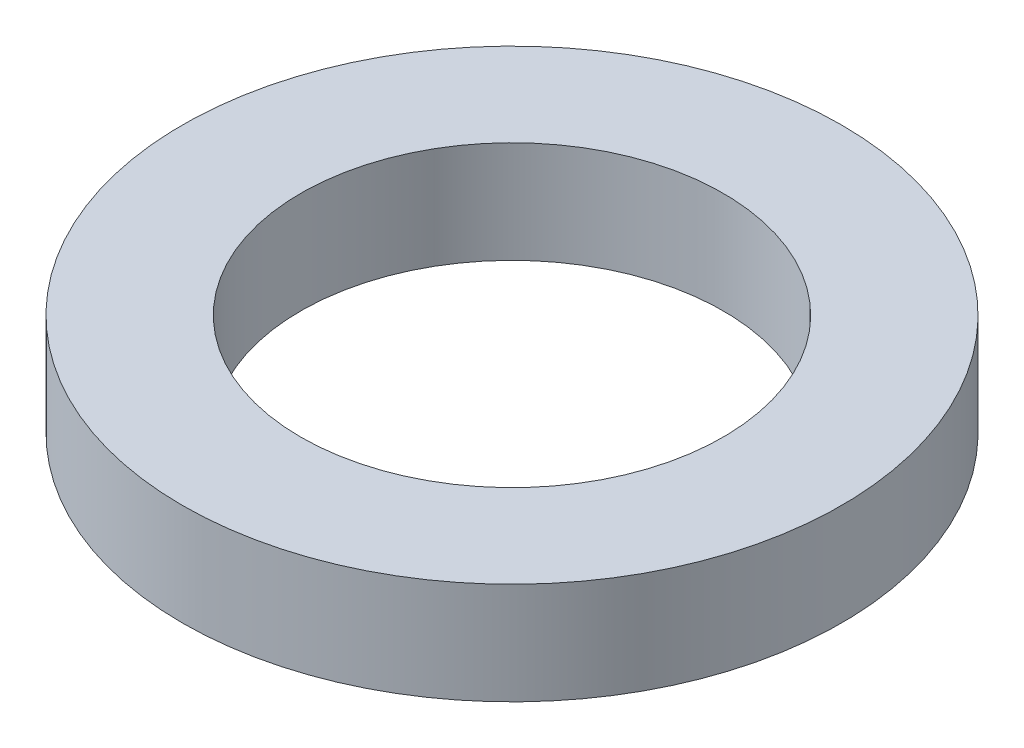
ISO-10303-21;
HEADER;
FILE_DESCRIPTION(('STEP AP214'),'2;1');
FILE_NAME('part.step','',(''),(''),'','','');
FILE_SCHEMA(('AUTOMOTIVE_DESIGN { 1 0 10303 214 1 1 1 1 }'));
ENDSEC;
DATA;
#1=APPLICATION_CONTEXT('core data for automotive mechanical design processes');
#2=APPLICATION_PROTOCOL_DEFINITION('international standard','automotive_design',2000,#1);
#3=PRODUCT_CONTEXT('',#1,'mechanical');
#4=PRODUCT('Part','Part','',(#3));
#5=PRODUCT_RELATED_PRODUCT_CATEGORY('part','',(#4));
#6=PRODUCT_DEFINITION_FORMATION('','',#4);
#7=PRODUCT_DEFINITION_CONTEXT('part definition',#1,'design');
#8=PRODUCT_DEFINITION('design','',#6,#7);
#9=PRODUCT_DEFINITION_SHAPE('','',#8);
#10=(LENGTH_UNIT() NAMED_UNIT(*) SI_UNIT(.MILLI.,.METRE.));
#11=(NAMED_UNIT(*) PLANE_ANGLE_UNIT() SI_UNIT($,.RADIAN.));
#12=(NAMED_UNIT(*) SI_UNIT($,.STERADIAN.) SOLID_ANGLE_UNIT());
#13=UNCERTAINTY_MEASURE_WITH_UNIT(LENGTH_MEASURE(1.E-05),#10,'distance_accuracy_value','');
#14=(GEOMETRIC_REPRESENTATION_CONTEXT(3) GLOBAL_UNCERTAINTY_ASSIGNED_CONTEXT((#13)) GLOBAL_UNIT_ASSIGNED_CONTEXT((#10,
#11,#12)) REPRESENTATION_CONTEXT('',''));
#15=CARTESIAN_POINT('',(0.,0.,0.));
#16=DIRECTION('',(0.,0.,1.));
#17=DIRECTION('',(1.,0.,0.));
#18=AXIS2_PLACEMENT_3D('',#15,#16,#17);
#19=CARTESIAN_POINT('',(0.,3.4,0.));
#20=DIRECTION('',(0.,1.,0.));
#21=DIRECTION('',(0.,0.,1.));
#22=AXIS2_PLACEMENT_3D('',#19,#20,#21);
#23=PLANE('',#22);
#24=CARTESIAN_POINT('',(0.,3.4,0.));
#25=DIRECTION('',(0.,1.,0.));
#26=DIRECTION('',(0.,0.,1.));
#27=AXIS2_PLACEMENT_3D('',#24,#25,#26);
#28=CIRCLE('',#27,11.);
#29=CARTESIAN_POINT('',(0.,3.4,11.));
#30=VERTEX_POINT('',#29);
#31=EDGE_CURVE('E10',#30,#30,#28,.T.);
#32=ORIENTED_EDGE('',*,*,#31,.T.);
#33=EDGE_LOOP('',(#32));
#34=FACE_BOUND('',#33,.T.);
#35=CARTESIAN_POINT('',(0.,3.4,0.));
#36=DIRECTION('',(0.,1.,0.));
#37=DIRECTION('',(0.,0.,1.));
#38=AXIS2_PLACEMENT_3D('',#35,#36,#37);
#39=CIRCLE('',#38,7.05);
#40=CARTESIAN_POINT('',(0.,3.4,7.05));
#41=VERTEX_POINT('',#40);
#42=EDGE_CURVE('E45',#41,#41,#39,.T.);
#43=ORIENTED_EDGE('',*,*,#42,.F.);
#44=EDGE_LOOP('',(#43));
#45=FACE_BOUND('',#44,.T.);
#46=ADVANCED_FACE('F34',(#34,#45),#23,.T.);
#47=CARTESIAN_POINT('',(0.,0.,0.));
#48=DIRECTION('',(0.,1.,0.));
#49=DIRECTION('',(0.,0.,1.));
#50=AXIS2_PLACEMENT_3D('',#47,#48,#49);
#51=PLANE('',#50);
#52=CARTESIAN_POINT('',(0.,0.,0.));
#53=DIRECTION('',(0.,1.,0.));
#54=DIRECTION('',(0.,0.,1.));
#55=AXIS2_PLACEMENT_3D('',#52,#53,#54);
#56=CIRCLE('',#55,11.);
#57=CARTESIAN_POINT('',(0.,0.,11.));
#58=VERTEX_POINT('',#57);
#59=EDGE_CURVE('E38',#58,#58,#56,.T.);
#60=ORIENTED_EDGE('',*,*,#59,.F.);
#61=EDGE_LOOP('',(#60));
#62=FACE_BOUND('',#61,.T.);
#63=CARTESIAN_POINT('',(0.,0.,0.));
#64=DIRECTION('',(0.,1.,0.));
#65=DIRECTION('',(0.,0.,1.));
#66=AXIS2_PLACEMENT_3D('',#63,#64,#65);
#67=CIRCLE('',#66,7.05);
#68=CARTESIAN_POINT('',(0.,0.,7.05));
#69=VERTEX_POINT('',#68);
#70=EDGE_CURVE('E47',#69,#69,#67,.T.);
#71=ORIENTED_EDGE('',*,*,#70,.T.);
#72=EDGE_LOOP('',(#71));
#73=FACE_BOUND('',#72,.T.);
#74=ADVANCED_FACE('F57',(#62,#73),#51,.F.);
#75=CARTESIAN_POINT('',(0.,3.4,0.));
#76=DIRECTION('',(0.,-1.,0.));
#77=DIRECTION('',(0.,0.,-1.));
#78=AXIS2_PLACEMENT_3D('',#75,#76,#77);
#79=CYLINDRICAL_SURFACE('',#78,11.);
#80=ORIENTED_EDGE('',*,*,#31,.F.);
#81=EDGE_LOOP('',(#80));
#82=FACE_BOUND('',#81,.T.);
#83=ORIENTED_EDGE('',*,*,#59,.T.);
#84=EDGE_LOOP('',(#83));
#85=FACE_BOUND('',#84,.T.);
#86=ADVANCED_FACE('F36',(#82,#85),#79,.T.);
#87=CARTESIAN_POINT('',(0.,3.4,0.));
#88=DIRECTION('',(0.,-1.,0.));
#89=DIRECTION('',(0.,0.,-1.));
#90=AXIS2_PLACEMENT_3D('',#87,#88,#89);
#91=CYLINDRICAL_SURFACE('',#90,7.05);
#92=ORIENTED_EDGE('',*,*,#42,.T.);
#93=EDGE_LOOP('',(#92));
#94=FACE_BOUND('',#93,.T.);
#95=ORIENTED_EDGE('',*,*,#70,.F.);
#96=EDGE_LOOP('',(#95));
#97=FACE_BOUND('',#96,.T.);
#98=ADVANCED_FACE('F53',(#94,#97),#91,.F.);
#99=CLOSED_SHELL('',(#46,#74,#86,#98));
#100=MANIFOLD_SOLID_BREP('B2',#99);
#101=ADVANCED_BREP_SHAPE_REPRESENTATION('',(#18,#100),#14);
#102=SHAPE_DEFINITION_REPRESENTATION(#9,#101);
ENDSEC;
END-ISO-10303-21;
